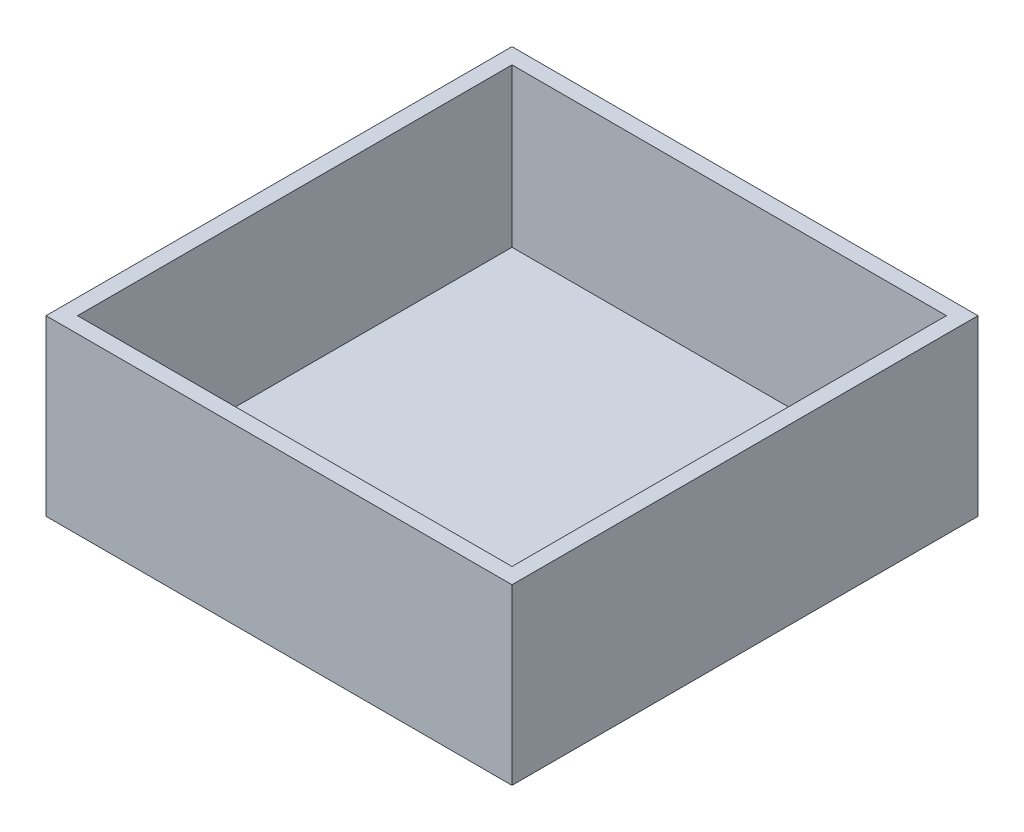
ISO-10303-21;
HEADER;
FILE_DESCRIPTION(('STEP AP214'),'2;1');
FILE_NAME('part.step','',(''),(''),'','','');
FILE_SCHEMA(('AUTOMOTIVE_DESIGN { 1 0 10303 214 1 1 1 1 }'));
ENDSEC;
DATA;
#1=APPLICATION_CONTEXT('core data for automotive mechanical design processes');
#2=APPLICATION_PROTOCOL_DEFINITION('international standard','automotive_design',2000,#1);
#3=PRODUCT_CONTEXT('',#1,'mechanical');
#4=PRODUCT('Part','Part','',(#3));
#5=PRODUCT_RELATED_PRODUCT_CATEGORY('part','',(#4));
#6=PRODUCT_DEFINITION_FORMATION('','',#4);
#7=PRODUCT_DEFINITION_CONTEXT('part definition',#1,'design');
#8=PRODUCT_DEFINITION('design','',#6,#7);
#9=PRODUCT_DEFINITION_SHAPE('','',#8);
#10=(LENGTH_UNIT() NAMED_UNIT(*) SI_UNIT(.MILLI.,.METRE.));
#11=(NAMED_UNIT(*) PLANE_ANGLE_UNIT() SI_UNIT($,.RADIAN.));
#12=(NAMED_UNIT(*) SI_UNIT($,.STERADIAN.) SOLID_ANGLE_UNIT());
#13=UNCERTAINTY_MEASURE_WITH_UNIT(LENGTH_MEASURE(1.E-05),#10,'distance_accuracy_value','');
#14=(GEOMETRIC_REPRESENTATION_CONTEXT(3) GLOBAL_UNCERTAINTY_ASSIGNED_CONTEXT((#13)) GLOBAL_UNIT_ASSIGNED_CONTEXT((#10,
#11,#12)) REPRESENTATION_CONTEXT('',''));
#15=CARTESIAN_POINT('',(0.,0.,0.));
#16=DIRECTION('',(0.,0.,1.));
#17=DIRECTION('',(1.,0.,0.));
#18=AXIS2_PLACEMENT_3D('',#15,#16,#17);
#19=CARTESIAN_POINT('',(0.,20.,0.));
#20=DIRECTION('',(0.,1.,0.));
#21=DIRECTION('',(0.,0.,1.));
#22=AXIS2_PLACEMENT_3D('',#19,#20,#21);
#23=PLANE('',#22);
#24=DIRECTION('',(0.,0.,1.));
#25=VECTOR('',#24,1.);
#26=CARTESIAN_POINT('',(0.,20.,0.));
#27=LINE('',#26,#25);
#28=CARTESIAN_POINT('',(0.,20.,0.));
#29=VERTEX_POINT('',#28);
#30=CARTESIAN_POINT('',(0.,20.,59.));
#31=VERTEX_POINT('',#30);
#32=EDGE_CURVE('E103',#29,#31,#27,.T.);
#33=ORIENTED_EDGE('',*,*,#32,.T.);
#34=DIRECTION('',(1.,0.,0.));
#35=VECTOR('',#34,1.);
#36=CARTESIAN_POINT('',(0.,20.,59.));
#37=LINE('',#36,#35);
#38=CARTESIAN_POINT('',(59.,20.,59.));
#39=VERTEX_POINT('',#38);
#40=EDGE_CURVE('E153',#31,#39,#37,.T.);
#41=ORIENTED_EDGE('',*,*,#40,.T.);
#42=DIRECTION('',(0.,0.,-1.));
#43=VECTOR('',#42,1.);
#44=CARTESIAN_POINT('',(59.,20.,0.));
#45=LINE('',#44,#43);
#46=CARTESIAN_POINT('',(59.,20.,0.));
#47=VERTEX_POINT('',#46);
#48=EDGE_CURVE('E155',#39,#47,#45,.T.);
#49=ORIENTED_EDGE('',*,*,#48,.T.);
#50=DIRECTION('',(-1.,0.,0.));
#51=VECTOR('',#50,1.);
#52=CARTESIAN_POINT('',(0.,20.,0.));
#53=LINE('',#52,#51);
#54=EDGE_CURVE('E56',#47,#29,#53,.T.);
#55=ORIENTED_EDGE('',*,*,#54,.T.);
#56=EDGE_LOOP('',(#33,#41,#49,#55));
#57=FACE_BOUND('',#56,.T.);
#58=DIRECTION('',(1.,0.,0.));
#59=VECTOR('',#58,1.);
#60=CARTESIAN_POINT('',(2.00000000000001,20.,57.));
#61=LINE('',#60,#59);
#62=CARTESIAN_POINT('',(2.00000000000001,20.,57.));
#63=VERTEX_POINT('',#62);
#64=CARTESIAN_POINT('',(57.,20.,57.));
#65=VERTEX_POINT('',#64);
#66=EDGE_CURVE('E127',#63,#65,#61,.T.);
#67=ORIENTED_EDGE('',*,*,#66,.F.);
#68=DIRECTION('',(0.,0.,1.));
#69=VECTOR('',#68,1.);
#70=CARTESIAN_POINT('',(2.,20.,2.));
#71=LINE('',#70,#69);
#72=CARTESIAN_POINT('',(2.,20.,2.));
#73=VERTEX_POINT('',#72);
#74=EDGE_CURVE('E125',#73,#63,#71,.T.);
#75=ORIENTED_EDGE('',*,*,#74,.F.);
#76=DIRECTION('',(-1.,0.,0.));
#77=VECTOR('',#76,1.);
#78=CARTESIAN_POINT('',(2.,20.,2.));
#79=LINE('',#78,#77);
#80=CARTESIAN_POINT('',(57.,20.,2.));
#81=VERTEX_POINT('',#80);
#82=EDGE_CURVE('E132',#81,#73,#79,.T.);
#83=ORIENTED_EDGE('',*,*,#82,.F.);
#84=DIRECTION('',(0.,0.,-1.));
#85=VECTOR('',#84,1.);
#86=CARTESIAN_POINT('',(57.,20.,2.));
#87=LINE('',#86,#85);
#88=EDGE_CURVE('E130',#65,#81,#87,.T.);
#89=ORIENTED_EDGE('',*,*,#88,.F.);
#90=EDGE_LOOP('',(#67,#75,#83,#89));
#91=FACE_BOUND('',#90,.T.);
#92=ADVANCED_FACE('F33',(#57,#91),#23,.T.);
#93=CARTESIAN_POINT('',(0.,20.,0.));
#94=DIRECTION('',(1.,0.,0.));
#95=DIRECTION('',(0.,0.,-1.));
#96=AXIS2_PLACEMENT_3D('',#93,#94,#95);
#97=PLANE('',#96);
#98=DIRECTION('',(0.,-1.,0.));
#99=VECTOR('',#98,1.);
#100=CARTESIAN_POINT('',(0.,20.,0.));
#101=LINE('',#100,#99);
#102=CARTESIAN_POINT('',(0.,-2.,0.));
#103=VERTEX_POINT('',#102);
#104=EDGE_CURVE('E98',#29,#103,#101,.T.);
#105=ORIENTED_EDGE('',*,*,#104,.T.);
#106=DIRECTION('',(0.,0.,-1.));
#107=VECTOR('',#106,1.);
#108=CARTESIAN_POINT('',(0.,-2.,0.));
#109=LINE('',#108,#107);
#110=CARTESIAN_POINT('',(0.,-2.,59.));
#111=VERTEX_POINT('',#110);
#112=EDGE_CURVE('E102',#111,#103,#109,.T.);
#113=ORIENTED_EDGE('',*,*,#112,.F.);
#114=DIRECTION('',(0.,-1.,0.));
#115=VECTOR('',#114,1.);
#116=CARTESIAN_POINT('',(0.,20.,59.));
#117=LINE('',#116,#115);
#118=EDGE_CURVE('E11',#31,#111,#117,.T.);
#119=ORIENTED_EDGE('',*,*,#118,.F.);
#120=ORIENTED_EDGE('',*,*,#32,.F.);
#121=EDGE_LOOP('',(#105,#113,#119,#120));
#122=FACE_BOUND('',#121,.T.);
#123=ADVANCED_FACE('F35',(#122),#97,.F.);
#124=CARTESIAN_POINT('',(0.,20.,59.));
#125=DIRECTION('',(0.,0.,-1.));
#126=DIRECTION('',(-1.,0.,0.));
#127=AXIS2_PLACEMENT_3D('',#124,#125,#126);
#128=PLANE('',#127);
#129=ORIENTED_EDGE('',*,*,#118,.T.);
#130=DIRECTION('',(-1.,0.,0.));
#131=VECTOR('',#130,1.);
#132=CARTESIAN_POINT('',(0.,-2.,59.));
#133=LINE('',#132,#131);
#134=CARTESIAN_POINT('',(59.,-2.,59.));
#135=VERTEX_POINT('',#134);
#136=EDGE_CURVE('E119',#135,#111,#133,.T.);
#137=ORIENTED_EDGE('',*,*,#136,.F.);
#138=DIRECTION('',(0.,-1.,0.));
#139=VECTOR('',#138,1.);
#140=CARTESIAN_POINT('',(59.,20.,59.));
#141=LINE('',#140,#139);
#142=EDGE_CURVE('E41',#39,#135,#141,.T.);
#143=ORIENTED_EDGE('',*,*,#142,.F.);
#144=ORIENTED_EDGE('',*,*,#40,.F.);
#145=EDGE_LOOP('',(#129,#137,#143,#144));
#146=FACE_BOUND('',#145,.T.);
#147=ADVANCED_FACE('F163',(#146),#128,.F.);
#148=CARTESIAN_POINT('',(59.,20.,0.));
#149=DIRECTION('',(-1.,0.,0.));
#150=DIRECTION('',(0.,0.,1.));
#151=AXIS2_PLACEMENT_3D('',#148,#149,#150);
#152=PLANE('',#151);
#153=ORIENTED_EDGE('',*,*,#142,.T.);
#154=DIRECTION('',(0.,0.,1.));
#155=VECTOR('',#154,1.);
#156=CARTESIAN_POINT('',(59.,-2.,0.));
#157=LINE('',#156,#155);
#158=CARTESIAN_POINT('',(59.,-2.,0.));
#159=VERTEX_POINT('',#158);
#160=EDGE_CURVE('E114',#159,#135,#157,.T.);
#161=ORIENTED_EDGE('',*,*,#160,.F.);
#162=DIRECTION('',(0.,-1.,0.));
#163=VECTOR('',#162,1.);
#164=CARTESIAN_POINT('',(59.,20.,0.));
#165=LINE('',#164,#163);
#166=EDGE_CURVE('E105',#47,#159,#165,.T.);
#167=ORIENTED_EDGE('',*,*,#166,.F.);
#168=ORIENTED_EDGE('',*,*,#48,.F.);
#169=EDGE_LOOP('',(#153,#161,#167,#168));
#170=FACE_BOUND('',#169,.T.);
#171=ADVANCED_FACE('F161',(#170),#152,.F.);
#172=CARTESIAN_POINT('',(0.,20.,0.));
#173=DIRECTION('',(0.,0.,1.));
#174=DIRECTION('',(1.,0.,0.));
#175=AXIS2_PLACEMENT_3D('',#172,#173,#174);
#176=PLANE('',#175);
#177=ORIENTED_EDGE('',*,*,#166,.T.);
#178=DIRECTION('',(1.,0.,0.));
#179=VECTOR('',#178,1.);
#180=CARTESIAN_POINT('',(0.,-2.,0.));
#181=LINE('',#180,#179);
#182=EDGE_CURVE('E108',#103,#159,#181,.T.);
#183=ORIENTED_EDGE('',*,*,#182,.F.);
#184=ORIENTED_EDGE('',*,*,#104,.F.);
#185=ORIENTED_EDGE('',*,*,#54,.F.);
#186=EDGE_LOOP('',(#177,#183,#184,#185));
#187=FACE_BOUND('',#186,.T.);
#188=ADVANCED_FACE('F109',(#187),#176,.F.);
#189=CARTESIAN_POINT('',(2.,20.,2.));
#190=DIRECTION('',(1.,0.,0.));
#191=DIRECTION('',(0.,0.,-1.));
#192=AXIS2_PLACEMENT_3D('',#189,#190,#191);
#193=PLANE('',#192);
#194=DIRECTION('',(0.,0.,1.));
#195=VECTOR('',#194,1.);
#196=CARTESIAN_POINT('',(2.,0.,2.));
#197=LINE('',#196,#195);
#198=CARTESIAN_POINT('',(2.,0.,2.));
#199=VERTEX_POINT('',#198);
#200=CARTESIAN_POINT('',(2.00000000000001,0.,57.));
#201=VERTEX_POINT('',#200);
#202=EDGE_CURVE('E124',#199,#201,#197,.T.);
#203=ORIENTED_EDGE('',*,*,#202,.F.);
#204=DIRECTION('',(0.,-1.,0.));
#205=VECTOR('',#204,1.);
#206=CARTESIAN_POINT('',(2.,20.,2.));
#207=LINE('',#206,#205);
#208=EDGE_CURVE('E134',#73,#199,#207,.T.);
#209=ORIENTED_EDGE('',*,*,#208,.F.);
#210=ORIENTED_EDGE('',*,*,#74,.T.);
#211=DIRECTION('',(0.,-1.,0.));
#212=VECTOR('',#211,1.);
#213=CARTESIAN_POINT('',(2.00000000000001,20.,57.));
#214=LINE('',#213,#212);
#215=EDGE_CURVE('E149',#63,#201,#214,.T.);
#216=ORIENTED_EDGE('',*,*,#215,.T.);
#217=EDGE_LOOP('',(#203,#209,#210,#216));
#218=FACE_BOUND('',#217,.T.);
#219=ADVANCED_FACE('F182',(#218),#193,.T.);
#220=CARTESIAN_POINT('',(2.00000000000001,20.,57.));
#221=DIRECTION('',(0.,0.,-1.));
#222=DIRECTION('',(-1.,0.,0.));
#223=AXIS2_PLACEMENT_3D('',#220,#221,#222);
#224=PLANE('',#223);
#225=DIRECTION('',(1.,0.,0.));
#226=VECTOR('',#225,1.);
#227=CARTESIAN_POINT('',(2.00000000000001,0.,57.));
#228=LINE('',#227,#226);
#229=CARTESIAN_POINT('',(57.,0.,57.));
#230=VERTEX_POINT('',#229);
#231=EDGE_CURVE('E137',#201,#230,#228,.T.);
#232=ORIENTED_EDGE('',*,*,#231,.F.);
#233=ORIENTED_EDGE('',*,*,#215,.F.);
#234=ORIENTED_EDGE('',*,*,#66,.T.);
#235=DIRECTION('',(0.,-1.,0.));
#236=VECTOR('',#235,1.);
#237=CARTESIAN_POINT('',(57.,20.,57.));
#238=LINE('',#237,#236);
#239=EDGE_CURVE('E147',#65,#230,#238,.T.);
#240=ORIENTED_EDGE('',*,*,#239,.T.);
#241=EDGE_LOOP('',(#232,#233,#234,#240));
#242=FACE_BOUND('',#241,.T.);
#243=ADVANCED_FACE('F174',(#242),#224,.T.);
#244=CARTESIAN_POINT('',(57.,20.,2.));
#245=DIRECTION('',(-1.,0.,0.));
#246=DIRECTION('',(0.,0.,1.));
#247=AXIS2_PLACEMENT_3D('',#244,#245,#246);
#248=PLANE('',#247);
#249=DIRECTION('',(0.,0.,-1.));
#250=VECTOR('',#249,1.);
#251=CARTESIAN_POINT('',(57.,0.,2.));
#252=LINE('',#251,#250);
#253=CARTESIAN_POINT('',(57.,0.,2.));
#254=VERTEX_POINT('',#253);
#255=EDGE_CURVE('E140',#230,#254,#252,.T.);
#256=ORIENTED_EDGE('',*,*,#255,.F.);
#257=ORIENTED_EDGE('',*,*,#239,.F.);
#258=ORIENTED_EDGE('',*,*,#88,.T.);
#259=DIRECTION('',(0.,-1.,0.));
#260=VECTOR('',#259,1.);
#261=CARTESIAN_POINT('',(57.,20.,2.));
#262=LINE('',#261,#260);
#263=EDGE_CURVE('E48',#81,#254,#262,.T.);
#264=ORIENTED_EDGE('',*,*,#263,.T.);
#265=EDGE_LOOP('',(#256,#257,#258,#264));
#266=FACE_BOUND('',#265,.T.);
#267=ADVANCED_FACE('F177',(#266),#248,.T.);
#268=CARTESIAN_POINT('',(2.,20.,2.));
#269=DIRECTION('',(0.,0.,1.));
#270=DIRECTION('',(1.,0.,0.));
#271=AXIS2_PLACEMENT_3D('',#268,#269,#270);
#272=PLANE('',#271);
#273=DIRECTION('',(-1.,0.,0.));
#274=VECTOR('',#273,1.);
#275=CARTESIAN_POINT('',(2.,0.,2.));
#276=LINE('',#275,#274);
#277=EDGE_CURVE('E128',#254,#199,#276,.T.);
#278=ORIENTED_EDGE('',*,*,#277,.F.);
#279=ORIENTED_EDGE('',*,*,#263,.F.);
#280=ORIENTED_EDGE('',*,*,#82,.T.);
#281=ORIENTED_EDGE('',*,*,#208,.T.);
#282=EDGE_LOOP('',(#278,#279,#280,#281));
#283=FACE_BOUND('',#282,.T.);
#284=ADVANCED_FACE('F184',(#283),#272,.T.);
#285=CARTESIAN_POINT('',(0.,0.,0.));
#286=DIRECTION('',(0.,1.,0.));
#287=DIRECTION('',(0.,0.,1.));
#288=AXIS2_PLACEMENT_3D('',#285,#286,#287);
#289=PLANE('',#288);
#290=ORIENTED_EDGE('',*,*,#277,.T.);
#291=ORIENTED_EDGE('',*,*,#202,.T.);
#292=ORIENTED_EDGE('',*,*,#231,.T.);
#293=ORIENTED_EDGE('',*,*,#255,.T.);
#294=EDGE_LOOP('',(#290,#291,#292,#293));
#295=FACE_BOUND('',#294,.T.);
#296=ADVANCED_FACE('F179',(#295),#289,.T.);
#297=CARTESIAN_POINT('',(0.,-2.,0.));
#298=DIRECTION('',(0.,1.,0.));
#299=DIRECTION('',(0.,0.,1.));
#300=AXIS2_PLACEMENT_3D('',#297,#298,#299);
#301=PLANE('',#300);
#302=ORIENTED_EDGE('',*,*,#112,.T.);
#303=ORIENTED_EDGE('',*,*,#182,.T.);
#304=ORIENTED_EDGE('',*,*,#160,.T.);
#305=ORIENTED_EDGE('',*,*,#136,.T.);
#306=EDGE_LOOP('',(#302,#303,#304,#305));
#307=FACE_BOUND('',#306,.T.);
#308=ADVANCED_FACE('F117',(#307),#301,.F.);
#309=CLOSED_SHELL('',(#92,#123,#147,#171,#188,#219,#243,#267,#284,#296,#308));
#310=MANIFOLD_SOLID_BREP('B2',#309);
#311=ADVANCED_BREP_SHAPE_REPRESENTATION('',(#18,#310),#14);
#312=SHAPE_DEFINITION_REPRESENTATION(#9,#311);
ENDSEC;
END-ISO-10303-21;
